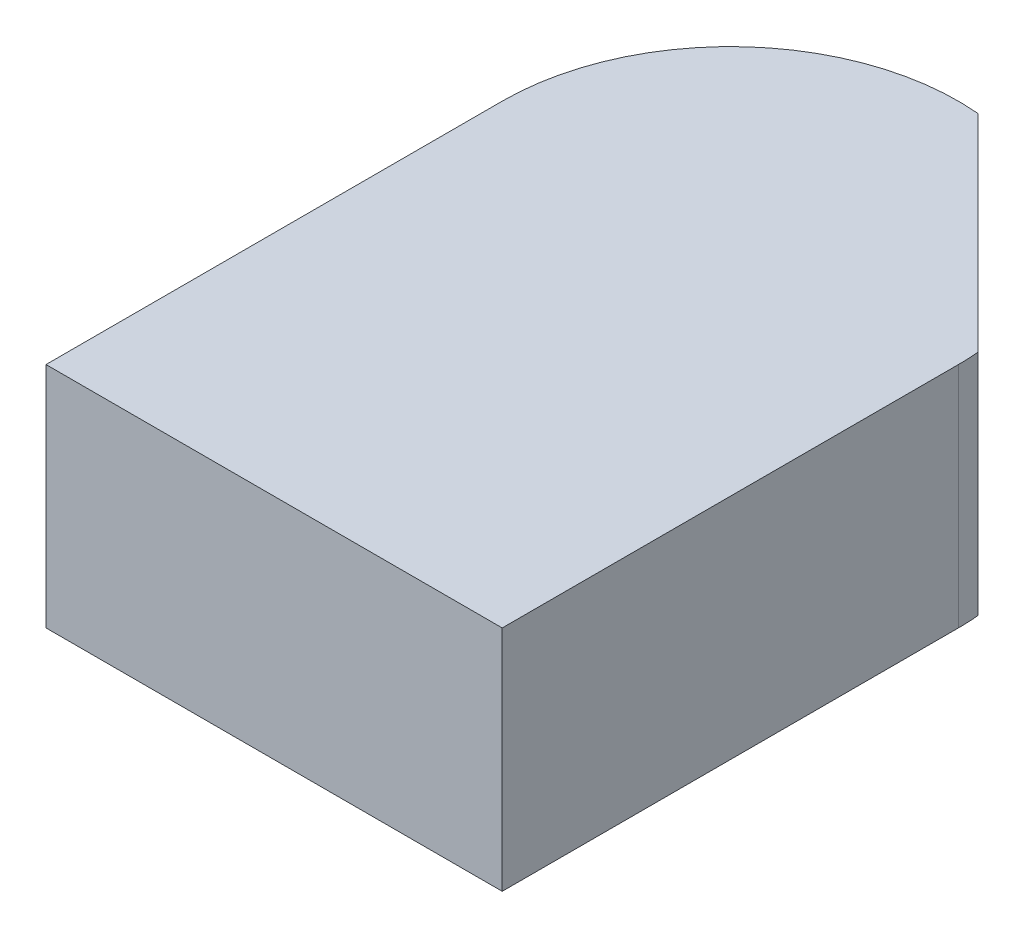
ISO-10303-21;
HEADER;
FILE_DESCRIPTION(('STEP AP214'),'2;1');
FILE_NAME('part.step','',(''),(''),'','','');
FILE_SCHEMA(('AUTOMOTIVE_DESIGN { 1 0 10303 214 1 1 1 1 }'));
ENDSEC;
DATA;
#1=APPLICATION_CONTEXT('core data for automotive mechanical design processes');
#2=APPLICATION_PROTOCOL_DEFINITION('international standard','automotive_design',2000,#1);
#3=PRODUCT_CONTEXT('',#1,'mechanical');
#4=PRODUCT('Part','Part','',(#3));
#5=PRODUCT_RELATED_PRODUCT_CATEGORY('part','',(#4));
#6=PRODUCT_DEFINITION_FORMATION('','',#4);
#7=PRODUCT_DEFINITION_CONTEXT('part definition',#1,'design');
#8=PRODUCT_DEFINITION('design','',#6,#7);
#9=PRODUCT_DEFINITION_SHAPE('','',#8);
#10=(LENGTH_UNIT() NAMED_UNIT(*) SI_UNIT(.MILLI.,.METRE.));
#11=(NAMED_UNIT(*) PLANE_ANGLE_UNIT() SI_UNIT($,.RADIAN.));
#12=(NAMED_UNIT(*) SI_UNIT($,.STERADIAN.) SOLID_ANGLE_UNIT());
#13=UNCERTAINTY_MEASURE_WITH_UNIT(LENGTH_MEASURE(1.E-05),#10,'distance_accuracy_value','');
#14=(GEOMETRIC_REPRESENTATION_CONTEXT(3) GLOBAL_UNCERTAINTY_ASSIGNED_CONTEXT((#13)) GLOBAL_UNIT_ASSIGNED_CONTEXT((#10,
#11,#12)) REPRESENTATION_CONTEXT('',''));
#15=CARTESIAN_POINT('',(0.,0.,0.));
#16=DIRECTION('',(0.,0.,1.));
#17=DIRECTION('',(1.,0.,0.));
#18=AXIS2_PLACEMENT_3D('',#15,#16,#17);
#19=CARTESIAN_POINT('',(0.,0.,0.));
#20=DIRECTION('',(0.,-1.,0.));
#21=DIRECTION('',(1.,0.,0.));
#22=AXIS2_PLACEMENT_3D('',#19,#20,#21);
#23=PLANE('',#22);
#24=CARTESIAN_POINT('',(0.8,0.,2.05));
#25=DIRECTION('',(0.,-1.,0.));
#26=DIRECTION('',(0.995957180044505,0.,-0.0898292575823554));
#27=AXIS2_PLACEMENT_3D('',#24,#25,#26);
#28=CIRCLE('',#27,0.1);
#29=CARTESIAN_POINT('',(0.899595718004,0.,2.041017074242));
#30=VERTEX_POINT('',#29);
#31=CARTESIAN_POINT('',(0.9,0.,2.05));
#32=VERTEX_POINT('',#31);
#33=EDGE_CURVE('E11',#30,#32,#28,.T.);
#34=ORIENTED_EDGE('',*,*,#33,.T.);
#35=DIRECTION('',(0.,0.,1.));
#36=VECTOR('',#35,1.);
#37=CARTESIAN_POINT('',(0.9,0.,2.05));
#38=LINE('',#37,#36);
#39=CARTESIAN_POINT('',(0.9,0.,2.25));
#40=VERTEX_POINT('',#39);
#41=EDGE_CURVE('E25',#32,#40,#38,.T.);
#42=ORIENTED_EDGE('',*,*,#41,.T.);
#43=DIRECTION('',(-1.,0.,0.));
#44=VECTOR('',#43,1.);
#45=CARTESIAN_POINT('',(0.9,0.,2.25));
#46=LINE('',#45,#44);
#47=CARTESIAN_POINT('',(0.7,0.,2.25));
#48=VERTEX_POINT('',#47);
#49=EDGE_CURVE('E145',#40,#48,#46,.T.);
#50=ORIENTED_EDGE('',*,*,#49,.T.);
#51=DIRECTION('',(0.,0.,-1.));
#52=VECTOR('',#51,1.);
#53=CARTESIAN_POINT('',(0.7,0.,2.25));
#54=LINE('',#53,#52);
#55=CARTESIAN_POINT('',(0.7,0.,2.05));
#56=VERTEX_POINT('',#55);
#57=EDGE_CURVE('E141',#48,#56,#54,.T.);
#58=ORIENTED_EDGE('',*,*,#57,.T.);
#59=CARTESIAN_POINT('',(0.8,0.,2.05));
#60=DIRECTION('',(0.,-1.,0.));
#61=DIRECTION('',(-1.,0.,0.));
#62=AXIS2_PLACEMENT_3D('',#59,#60,#61);
#63=CIRCLE('',#62,0.1);
#64=CARTESIAN_POINT('',(0.808982925758,0.,1.950404281996));
#65=VERTEX_POINT('',#64);
#66=EDGE_CURVE('E89',#56,#65,#63,.T.);
#67=ORIENTED_EDGE('',*,*,#66,.T.);
#68=DIRECTION('',(-0.707106781186548,0.,-0.707106781186548));
#69=VECTOR('',#68,1.);
#70=CARTESIAN_POINT('',(0.899595718004,0.,2.041017074242));
#71=LINE('',#70,#69);
#72=EDGE_CURVE('E133',#30,#65,#71,.T.);
#73=ORIENTED_EDGE('',*,*,#72,.F.);
#74=EDGE_LOOP('',(#34,#42,#50,#58,#67,#73));
#75=FACE_BOUND('',#74,.T.);
#76=ADVANCED_FACE('F17',(#75),#23,.T.);
#77=CARTESIAN_POINT('',(0.899595718005,-0.02,2.041017074242));
#78=DIRECTION('',(0.707106781186548,0.,-0.707106781186548));
#79=DIRECTION('',(-0.707106781186548,0.,-0.707106781186548));
#80=AXIS2_PLACEMENT_3D('',#77,#78,#79);
#81=PLANE('',#80);
#82=DIRECTION('',(0.,-1.,0.));
#83=VECTOR('',#82,1.);
#84=CARTESIAN_POINT('',(0.808982925758,0.1,1.950404281996));
#85=LINE('',#84,#83);
#86=CARTESIAN_POINT('',(0.808982925758,0.1,1.950404281996));
#87=VERTEX_POINT('',#86);
#88=EDGE_CURVE('E129',#87,#65,#85,.T.);
#89=ORIENTED_EDGE('',*,*,#88,.F.);
#90=DIRECTION('',(-0.707106781186548,0.,-0.707106781186548));
#91=VECTOR('',#90,1.);
#92=CARTESIAN_POINT('',(0.899595718005,0.1,2.041017074242));
#93=LINE('',#92,#91);
#94=CARTESIAN_POINT('',(0.899595718005,0.1,2.041017074242));
#95=VERTEX_POINT('',#94);
#96=EDGE_CURVE('E84',#95,#87,#93,.T.);
#97=ORIENTED_EDGE('',*,*,#96,.F.);
#98=DIRECTION('',(0.,-1.,0.));
#99=VECTOR('',#98,1.);
#100=CARTESIAN_POINT('',(0.899595718004,0.1,2.041017074242));
#101=LINE('',#100,#99);
#102=EDGE_CURVE('E121',#95,#30,#101,.T.);
#103=ORIENTED_EDGE('',*,*,#102,.T.);
#104=ORIENTED_EDGE('',*,*,#72,.T.);
#105=EDGE_LOOP('',(#89,#97,#103,#104));
#106=FACE_BOUND('',#105,.T.);
#107=ADVANCED_FACE('F163',(#106),#81,.T.);
#108=CARTESIAN_POINT('',(0.8,0.,2.05));
#109=DIRECTION('',(0.,-1.,0.));
#110=DIRECTION('',(-0.998988783731956,0.,0.0449600931688024));
#111=AXIS2_PLACEMENT_3D('',#108,#109,#110);
#112=CYLINDRICAL_SURFACE('',#111,0.1);
#113=CARTESIAN_POINT('',(0.8,0.1,2.05));
#114=DIRECTION('',(0.,-1.,0.));
#115=DIRECTION('',(0.995957180044505,0.,-0.0898292575823554));
#116=AXIS2_PLACEMENT_3D('',#113,#114,#115);
#117=CIRCLE('',#116,0.1);
#118=CARTESIAN_POINT('',(0.9,0.1,2.05));
#119=VERTEX_POINT('',#118);
#120=EDGE_CURVE('E117',#95,#119,#117,.T.);
#121=ORIENTED_EDGE('',*,*,#120,.T.);
#122=DIRECTION('',(0.,1.,0.));
#123=VECTOR('',#122,1.);
#124=CARTESIAN_POINT('',(0.9,0.,2.05));
#125=LINE('',#124,#123);
#126=EDGE_CURVE('E112',#32,#119,#125,.T.);
#127=ORIENTED_EDGE('',*,*,#126,.F.);
#128=ORIENTED_EDGE('',*,*,#33,.F.);
#129=ORIENTED_EDGE('',*,*,#102,.F.);
#130=EDGE_LOOP('',(#121,#127,#128,#129));
#131=FACE_BOUND('',#130,.T.);
#132=ADVANCED_FACE('F161',(#131),#112,.T.);
#133=CARTESIAN_POINT('',(0.9,0.,2.05));
#134=DIRECTION('',(-1.,0.,0.));
#135=DIRECTION('',(0.,0.,1.));
#136=AXIS2_PLACEMENT_3D('',#133,#134,#135);
#137=PLANE('',#136);
#138=ORIENTED_EDGE('',*,*,#126,.T.);
#139=DIRECTION('',(0.,0.,1.));
#140=VECTOR('',#139,1.);
#141=CARTESIAN_POINT('',(0.9,0.1,2.05));
#142=LINE('',#141,#140);
#143=CARTESIAN_POINT('',(0.9,0.1,2.25));
#144=VERTEX_POINT('',#143);
#145=EDGE_CURVE('E108',#119,#144,#142,.T.);
#146=ORIENTED_EDGE('',*,*,#145,.T.);
#147=DIRECTION('',(0.,1.,0.));
#148=VECTOR('',#147,1.);
#149=CARTESIAN_POINT('',(0.9,0.,2.25));
#150=LINE('',#149,#148);
#151=EDGE_CURVE('E103',#40,#144,#150,.T.);
#152=ORIENTED_EDGE('',*,*,#151,.F.);
#153=ORIENTED_EDGE('',*,*,#41,.F.);
#154=EDGE_LOOP('',(#138,#146,#152,#153));
#155=FACE_BOUND('',#154,.T.);
#156=ADVANCED_FACE('F159',(#155),#137,.F.);
#157=CARTESIAN_POINT('',(0.9,0.,2.25));
#158=DIRECTION('',(0.,0.,-1.));
#159=DIRECTION('',(-1.,0.,0.));
#160=AXIS2_PLACEMENT_3D('',#157,#158,#159);
#161=PLANE('',#160);
#162=ORIENTED_EDGE('',*,*,#151,.T.);
#163=DIRECTION('',(-1.,0.,0.));
#164=VECTOR('',#163,1.);
#165=CARTESIAN_POINT('',(0.9,0.1,2.25));
#166=LINE('',#165,#164);
#167=CARTESIAN_POINT('',(0.7,0.1,2.25));
#168=VERTEX_POINT('',#167);
#169=EDGE_CURVE('E99',#144,#168,#166,.T.);
#170=ORIENTED_EDGE('',*,*,#169,.T.);
#171=DIRECTION('',(0.,1.,0.));
#172=VECTOR('',#171,1.);
#173=CARTESIAN_POINT('',(0.7,0.,2.25));
#174=LINE('',#173,#172);
#175=EDGE_CURVE('E75',#48,#168,#174,.T.);
#176=ORIENTED_EDGE('',*,*,#175,.F.);
#177=ORIENTED_EDGE('',*,*,#49,.F.);
#178=EDGE_LOOP('',(#162,#170,#176,#177));
#179=FACE_BOUND('',#178,.T.);
#180=ADVANCED_FACE('F155',(#179),#161,.F.);
#181=CARTESIAN_POINT('',(0.7,0.,2.25));
#182=DIRECTION('',(1.,0.,0.));
#183=DIRECTION('',(0.,0.,-1.));
#184=AXIS2_PLACEMENT_3D('',#181,#182,#183);
#185=PLANE('',#184);
#186=ORIENTED_EDGE('',*,*,#175,.T.);
#187=DIRECTION('',(0.,0.,-1.));
#188=VECTOR('',#187,1.);
#189=CARTESIAN_POINT('',(0.7,0.1,2.25));
#190=LINE('',#189,#188);
#191=CARTESIAN_POINT('',(0.7,0.1,2.05));
#192=VERTEX_POINT('',#191);
#193=EDGE_CURVE('E67',#168,#192,#190,.T.);
#194=ORIENTED_EDGE('',*,*,#193,.T.);
#195=DIRECTION('',(0.,1.,0.));
#196=VECTOR('',#195,1.);
#197=CARTESIAN_POINT('',(0.7,0.,2.05));
#198=LINE('',#197,#196);
#199=EDGE_CURVE('E72',#56,#192,#198,.T.);
#200=ORIENTED_EDGE('',*,*,#199,.F.);
#201=ORIENTED_EDGE('',*,*,#57,.F.);
#202=EDGE_LOOP('',(#186,#194,#200,#201));
#203=FACE_BOUND('',#202,.T.);
#204=ADVANCED_FACE('F69',(#203),#185,.F.);
#205=CARTESIAN_POINT('',(0.8,0.,2.05));
#206=DIRECTION('',(0.,-1.,0.));
#207=DIRECTION('',(0.674600156544445,0.,0.738183330067952));
#208=AXIS2_PLACEMENT_3D('',#205,#206,#207);
#209=CYLINDRICAL_SURFACE('',#208,0.1);
#210=ORIENTED_EDGE('',*,*,#66,.F.);
#211=ORIENTED_EDGE('',*,*,#199,.T.);
#212=CARTESIAN_POINT('',(0.8,0.1,2.05));
#213=DIRECTION('',(0.,-1.,0.));
#214=DIRECTION('',(-1.,0.,0.));
#215=AXIS2_PLACEMENT_3D('',#212,#213,#214);
#216=CIRCLE('',#215,0.1);
#217=EDGE_CURVE('E81',#192,#87,#216,.T.);
#218=ORIENTED_EDGE('',*,*,#217,.T.);
#219=ORIENTED_EDGE('',*,*,#88,.T.);
#220=EDGE_LOOP('',(#210,#211,#218,#219));
#221=FACE_BOUND('',#220,.T.);
#222=ADVANCED_FACE('F88',(#221),#209,.T.);
#223=CARTESIAN_POINT('',(0.,0.1,0.));
#224=DIRECTION('',(0.,-1.,0.));
#225=DIRECTION('',(1.,0.,0.));
#226=AXIS2_PLACEMENT_3D('',#223,#224,#225);
#227=PLANE('',#226);
#228=ORIENTED_EDGE('',*,*,#217,.F.);
#229=ORIENTED_EDGE('',*,*,#193,.F.);
#230=ORIENTED_EDGE('',*,*,#169,.F.);
#231=ORIENTED_EDGE('',*,*,#145,.F.);
#232=ORIENTED_EDGE('',*,*,#120,.F.);
#233=ORIENTED_EDGE('',*,*,#96,.T.);
#234=EDGE_LOOP('',(#228,#229,#230,#231,#232,#233));
#235=FACE_BOUND('',#234,.T.);
#236=ADVANCED_FACE('F82',(#235),#227,.F.);
#237=CLOSED_SHELL('',(#76,#107,#132,#156,#180,#204,#222,#236));
#238=MANIFOLD_SOLID_BREP('B1',#237);
#239=ADVANCED_BREP_SHAPE_REPRESENTATION('',(#18,#238),#14);
#240=SHAPE_DEFINITION_REPRESENTATION(#9,#239);
ENDSEC;
END-ISO-10303-21;
